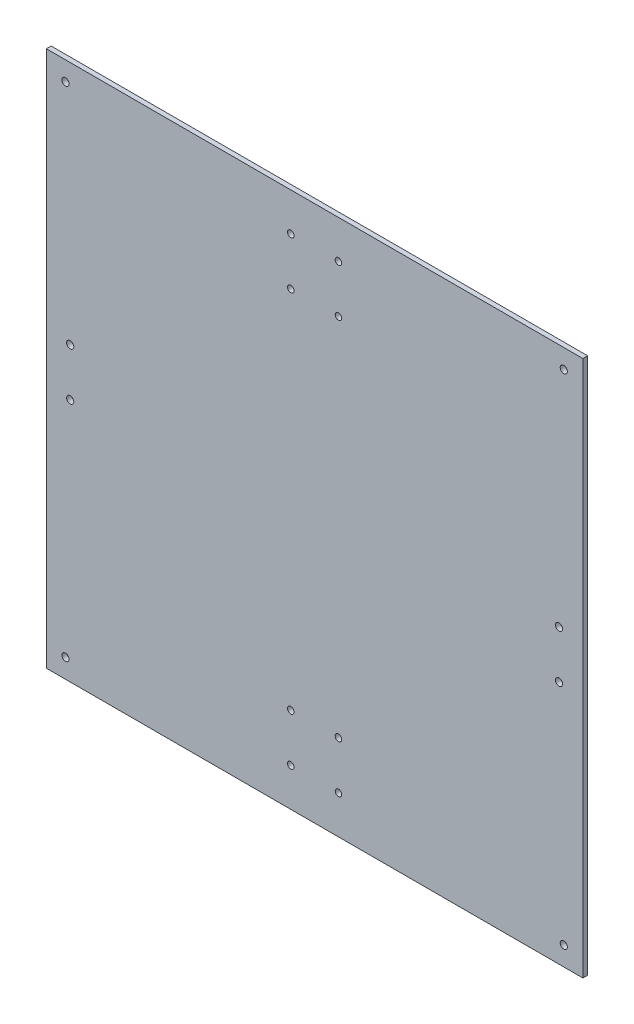
ISO-10303-21;
HEADER;
FILE_DESCRIPTION(('STEP AP214'),'2;1');
FILE_NAME('part.step','',(''),(''),'','','');
FILE_SCHEMA(('AUTOMOTIVE_DESIGN { 1 0 10303 214 1 1 1 1 }'));
ENDSEC;
DATA;
#1=APPLICATION_CONTEXT('core data for automotive mechanical design processes');
#2=APPLICATION_PROTOCOL_DEFINITION('international standard','automotive_design',2000,#1);
#3=PRODUCT_CONTEXT('',#1,'mechanical');
#4=PRODUCT('Part','Part','',(#3));
#5=PRODUCT_RELATED_PRODUCT_CATEGORY('part','',(#4));
#6=PRODUCT_DEFINITION_FORMATION('','',#4);
#7=PRODUCT_DEFINITION_CONTEXT('part definition',#1,'design');
#8=PRODUCT_DEFINITION('design','',#6,#7);
#9=PRODUCT_DEFINITION_SHAPE('','',#8);
#10=(LENGTH_UNIT() NAMED_UNIT(*) SI_UNIT(.MILLI.,.METRE.));
#11=(NAMED_UNIT(*) PLANE_ANGLE_UNIT() SI_UNIT($,.RADIAN.));
#12=(NAMED_UNIT(*) SI_UNIT($,.STERADIAN.) SOLID_ANGLE_UNIT());
#13=UNCERTAINTY_MEASURE_WITH_UNIT(LENGTH_MEASURE(1.E-05),#10,'distance_accuracy_value','');
#14=(GEOMETRIC_REPRESENTATION_CONTEXT(3) GLOBAL_UNCERTAINTY_ASSIGNED_CONTEXT((#13)) GLOBAL_UNIT_ASSIGNED_CONTEXT((#10,
#11,#12)) REPRESENTATION_CONTEXT('',''));
#15=CARTESIAN_POINT('',(0.,0.,0.));
#16=DIRECTION('',(0.,0.,1.));
#17=DIRECTION('',(1.,0.,0.));
#18=AXIS2_PLACEMENT_3D('',#15,#16,#17);
#19=CARTESIAN_POINT('',(0.,-199.,2.));
#20=DIRECTION('',(0.,-1.,0.));
#21=DIRECTION('',(1.,0.,0.));
#22=AXIS2_PLACEMENT_3D('',#19,#20,#21);
#23=PLANE('',#22);
#24=DIRECTION('',(-1.,0.,0.));
#25=VECTOR('',#24,1.);
#26=CARTESIAN_POINT('',(0.,-199.,0.));
#27=LINE('',#26,#25);
#28=CARTESIAN_POINT('',(112.5,-199.,0.));
#29=VERTEX_POINT('',#28);
#30=CARTESIAN_POINT('',(-112.5,-199.,0.));
#31=VERTEX_POINT('',#30);
#32=EDGE_CURVE('E149',#29,#31,#27,.T.);
#33=ORIENTED_EDGE('',*,*,#32,.F.);
#34=DIRECTION('',(0.,0.,-1.));
#35=VECTOR('',#34,1.);
#36=CARTESIAN_POINT('',(112.5,-199.,2.));
#37=LINE('',#36,#35);
#38=CARTESIAN_POINT('',(112.5,-199.,2.));
#39=VERTEX_POINT('',#38);
#40=EDGE_CURVE('E11',#39,#29,#37,.T.);
#41=ORIENTED_EDGE('',*,*,#40,.F.);
#42=DIRECTION('',(-1.,0.,0.));
#43=VECTOR('',#42,1.);
#44=CARTESIAN_POINT('',(0.,-199.,2.));
#45=LINE('',#44,#43);
#46=CARTESIAN_POINT('',(-112.5,-199.,2.));
#47=VERTEX_POINT('',#46);
#48=EDGE_CURVE('E94',#39,#47,#45,.T.);
#49=ORIENTED_EDGE('',*,*,#48,.T.);
#50=DIRECTION('',(0.,0.,-1.));
#51=VECTOR('',#50,1.);
#52=CARTESIAN_POINT('',(-112.5,-199.,2.));
#53=LINE('',#52,#51);
#54=EDGE_CURVE('E72',#47,#31,#53,.T.);
#55=ORIENTED_EDGE('',*,*,#54,.T.);
#56=EDGE_LOOP('',(#33,#41,#49,#55));
#57=FACE_BOUND('',#56,.T.);
#58=ADVANCED_FACE('F32',(#57),#23,.T.);
#59=CARTESIAN_POINT('',(112.5,0.,2.));
#60=DIRECTION('',(1.,0.,0.));
#61=DIRECTION('',(0.,1.,0.));
#62=AXIS2_PLACEMENT_3D('',#59,#60,#61);
#63=PLANE('',#62);
#64=DIRECTION('',(0.,-1.,0.));
#65=VECTOR('',#64,1.);
#66=CARTESIAN_POINT('',(112.5,0.,0.));
#67=LINE('',#66,#65);
#68=CARTESIAN_POINT('',(112.5,26.0000000000001,0.));
#69=VERTEX_POINT('',#68);
#70=EDGE_CURVE('E84',#69,#29,#67,.T.);
#71=ORIENTED_EDGE('',*,*,#70,.F.);
#72=DIRECTION('',(0.,0.,-1.));
#73=VECTOR('',#72,1.);
#74=CARTESIAN_POINT('',(112.5,26.0000000000001,2.));
#75=LINE('',#74,#73);
#76=CARTESIAN_POINT('',(112.5,26.0000000000001,2.));
#77=VERTEX_POINT('',#76);
#78=EDGE_CURVE('E41',#77,#69,#75,.T.);
#79=ORIENTED_EDGE('',*,*,#78,.F.);
#80=DIRECTION('',(0.,-1.,0.));
#81=VECTOR('',#80,1.);
#82=CARTESIAN_POINT('',(112.5,0.,2.));
#83=LINE('',#82,#81);
#84=EDGE_CURVE('E82',#77,#39,#83,.T.);
#85=ORIENTED_EDGE('',*,*,#84,.T.);
#86=ORIENTED_EDGE('',*,*,#40,.T.);
#87=EDGE_LOOP('',(#71,#79,#85,#86));
#88=FACE_BOUND('',#87,.T.);
#89=ADVANCED_FACE('F80',(#88),#63,.T.);
#90=CARTESIAN_POINT('',(0.,26.0000000000001,2.));
#91=DIRECTION('',(0.,-1.,0.));
#92=DIRECTION('',(1.,0.,0.));
#93=AXIS2_PLACEMENT_3D('',#90,#91,#92);
#94=PLANE('',#93);
#95=DIRECTION('',(-1.,0.,0.));
#96=VECTOR('',#95,1.);
#97=CARTESIAN_POINT('',(0.,26.0000000000001,0.));
#98=LINE('',#97,#96);
#99=CARTESIAN_POINT('',(-112.5,26.0000000000001,0.));
#100=VERTEX_POINT('',#99);
#101=EDGE_CURVE('E152',#69,#100,#98,.T.);
#102=ORIENTED_EDGE('',*,*,#101,.T.);
#103=DIRECTION('',(0.,0.,-1.));
#104=VECTOR('',#103,1.);
#105=CARTESIAN_POINT('',(-112.5,26.0000000000001,2.));
#106=LINE('',#105,#104);
#107=CARTESIAN_POINT('',(-112.5,26.0000000000001,2.));
#108=VERTEX_POINT('',#107);
#109=EDGE_CURVE('E87',#108,#100,#106,.T.);
#110=ORIENTED_EDGE('',*,*,#109,.F.);
#111=DIRECTION('',(-1.,0.,0.));
#112=VECTOR('',#111,1.);
#113=CARTESIAN_POINT('',(0.,26.0000000000001,2.));
#114=LINE('',#113,#112);
#115=EDGE_CURVE('E89',#77,#108,#114,.T.);
#116=ORIENTED_EDGE('',*,*,#115,.F.);
#117=ORIENTED_EDGE('',*,*,#78,.T.);
#118=EDGE_LOOP('',(#102,#110,#116,#117));
#119=FACE_BOUND('',#118,.T.);
#120=ADVANCED_FACE('F90',(#119),#94,.F.);
#121=CARTESIAN_POINT('',(102.5,-76.4999999999999,2.));
#122=DIRECTION('',(0.,0.,-1.));
#123=DIRECTION('',(-1.,0.,0.));
#124=AXIS2_PLACEMENT_3D('',#121,#122,#123);
#125=CYLINDRICAL_SURFACE('',#124,1.5);
#126=CARTESIAN_POINT('',(102.5,-76.4999999999999,2.));
#127=DIRECTION('',(0.,0.,1.));
#128=DIRECTION('',(1.,0.,0.));
#129=AXIS2_PLACEMENT_3D('',#126,#127,#128);
#130=CIRCLE('',#129,1.5);
#131=CARTESIAN_POINT('',(104.,-76.4999999999999,2.));
#132=VERTEX_POINT('',#131);
#133=EDGE_CURVE('E131',#132,#132,#130,.T.);
#134=ORIENTED_EDGE('',*,*,#133,.T.);
#135=EDGE_LOOP('',(#134));
#136=FACE_BOUND('',#135,.T.);
#137=CARTESIAN_POINT('',(102.5,-76.4999999999999,0.));
#138=DIRECTION('',(0.,0.,1.));
#139=DIRECTION('',(1.,0.,0.));
#140=AXIS2_PLACEMENT_3D('',#137,#138,#139);
#141=CIRCLE('',#140,1.5);
#142=CARTESIAN_POINT('',(104.,-76.4999999999999,0.));
#143=VERTEX_POINT('',#142);
#144=EDGE_CURVE('E185',#143,#143,#141,.T.);
#145=ORIENTED_EDGE('',*,*,#144,.F.);
#146=EDGE_LOOP('',(#145));
#147=FACE_BOUND('',#146,.T.);
#148=ADVANCED_FACE('F244',(#136,#147),#125,.F.);
#149=CARTESIAN_POINT('',(9.9999999999999,-163.,2.));
#150=DIRECTION('',(0.,0.,-1.));
#151=DIRECTION('',(-1.,0.,0.));
#152=AXIS2_PLACEMENT_3D('',#149,#150,#151);
#153=CYLINDRICAL_SURFACE('',#152,1.37499999999999);
#154=CARTESIAN_POINT('',(9.9999999999999,-163.,2.));
#155=DIRECTION('',(0.,0.,1.));
#156=DIRECTION('',(1.,0.,0.));
#157=AXIS2_PLACEMENT_3D('',#154,#155,#156);
#158=CIRCLE('',#157,1.37499999999999);
#159=CARTESIAN_POINT('',(11.3749999999999,-163.,2.));
#160=VERTEX_POINT('',#159);
#161=EDGE_CURVE('E128',#160,#160,#158,.T.);
#162=ORIENTED_EDGE('',*,*,#161,.T.);
#163=EDGE_LOOP('',(#162));
#164=FACE_BOUND('',#163,.T.);
#165=CARTESIAN_POINT('',(9.9999999999999,-163.,0.));
#166=DIRECTION('',(0.,0.,1.));
#167=DIRECTION('',(1.,0.,0.));
#168=AXIS2_PLACEMENT_3D('',#165,#166,#167);
#169=CIRCLE('',#168,1.37499999999999);
#170=CARTESIAN_POINT('',(11.3749999999999,-163.,0.));
#171=VERTEX_POINT('',#170);
#172=EDGE_CURVE('E182',#171,#171,#169,.T.);
#173=ORIENTED_EDGE('',*,*,#172,.F.);
#174=EDGE_LOOP('',(#173));
#175=FACE_BOUND('',#174,.T.);
#176=ADVANCED_FACE('F247',(#164,#175),#153,.F.);
#177=CARTESIAN_POINT('',(9.9999999999999,-183.,2.));
#178=DIRECTION('',(0.,0.,-1.));
#179=DIRECTION('',(-1.,0.,0.));
#180=AXIS2_PLACEMENT_3D('',#177,#178,#179);
#181=CYLINDRICAL_SURFACE('',#180,1.35);
#182=CARTESIAN_POINT('',(9.9999999999999,-183.,2.));
#183=DIRECTION('',(0.,0.,1.));
#184=DIRECTION('',(1.,0.,0.));
#185=AXIS2_PLACEMENT_3D('',#182,#183,#184);
#186=CIRCLE('',#185,1.35);
#187=CARTESIAN_POINT('',(11.3499999999999,-183.,2.));
#188=VERTEX_POINT('',#187);
#189=EDGE_CURVE('E125',#188,#188,#186,.T.);
#190=ORIENTED_EDGE('',*,*,#189,.T.);
#191=EDGE_LOOP('',(#190));
#192=FACE_BOUND('',#191,.T.);
#193=CARTESIAN_POINT('',(9.9999999999999,-183.,0.));
#194=DIRECTION('',(0.,0.,1.));
#195=DIRECTION('',(1.,0.,0.));
#196=AXIS2_PLACEMENT_3D('',#193,#194,#195);
#197=CIRCLE('',#196,1.35);
#198=CARTESIAN_POINT('',(11.3499999999999,-183.,0.));
#199=VERTEX_POINT('',#198);
#200=EDGE_CURVE('E179',#199,#199,#197,.T.);
#201=ORIENTED_EDGE('',*,*,#200,.F.);
#202=EDGE_LOOP('',(#201));
#203=FACE_BOUND('',#202,.T.);
#204=ADVANCED_FACE('F251',(#192,#203),#181,.F.);
#205=CARTESIAN_POINT('',(10.,10.,2.));
#206=DIRECTION('',(0.,0.,-1.));
#207=DIRECTION('',(-1.,0.,0.));
#208=AXIS2_PLACEMENT_3D('',#205,#206,#207);
#209=CYLINDRICAL_SURFACE('',#208,1.375);
#210=CARTESIAN_POINT('',(10.,10.,2.));
#211=DIRECTION('',(0.,0.,1.));
#212=DIRECTION('',(1.,0.,0.));
#213=AXIS2_PLACEMENT_3D('',#210,#211,#212);
#214=CIRCLE('',#213,1.375);
#215=CARTESIAN_POINT('',(11.375,10.,2.));
#216=VERTEX_POINT('',#215);
#217=EDGE_CURVE('E122',#216,#216,#214,.T.);
#218=ORIENTED_EDGE('',*,*,#217,.T.);
#219=EDGE_LOOP('',(#218));
#220=FACE_BOUND('',#219,.T.);
#221=CARTESIAN_POINT('',(10.,10.,0.));
#222=DIRECTION('',(0.,0.,1.));
#223=DIRECTION('',(1.,0.,0.));
#224=AXIS2_PLACEMENT_3D('',#221,#222,#223);
#225=CIRCLE('',#224,1.375);
#226=CARTESIAN_POINT('',(11.375,10.,0.));
#227=VERTEX_POINT('',#226);
#228=EDGE_CURVE('E176',#227,#227,#225,.T.);
#229=ORIENTED_EDGE('',*,*,#228,.F.);
#230=EDGE_LOOP('',(#229));
#231=FACE_BOUND('',#230,.T.);
#232=ADVANCED_FACE('F255',(#220,#231),#209,.F.);
#233=CARTESIAN_POINT('',(10.,-10.,2.));
#234=DIRECTION('',(0.,0.,-1.));
#235=DIRECTION('',(-1.,0.,0.));
#236=AXIS2_PLACEMENT_3D('',#233,#234,#235);
#237=CYLINDRICAL_SURFACE('',#236,1.35);
#238=CARTESIAN_POINT('',(10.,-10.,2.));
#239=DIRECTION('',(0.,0.,1.));
#240=DIRECTION('',(1.,0.,0.));
#241=AXIS2_PLACEMENT_3D('',#238,#239,#240);
#242=CIRCLE('',#241,1.35);
#243=CARTESIAN_POINT('',(11.35,-10.,2.));
#244=VERTEX_POINT('',#243);
#245=EDGE_CURVE('E119',#244,#244,#242,.T.);
#246=ORIENTED_EDGE('',*,*,#245,.T.);
#247=EDGE_LOOP('',(#246));
#248=FACE_BOUND('',#247,.T.);
#249=CARTESIAN_POINT('',(10.,-10.,0.));
#250=DIRECTION('',(0.,0.,1.));
#251=DIRECTION('',(1.,0.,0.));
#252=AXIS2_PLACEMENT_3D('',#249,#250,#251);
#253=CIRCLE('',#252,1.35);
#254=CARTESIAN_POINT('',(11.35,-10.,0.));
#255=VERTEX_POINT('',#254);
#256=EDGE_CURVE('E173',#255,#255,#253,.T.);
#257=ORIENTED_EDGE('',*,*,#256,.F.);
#258=EDGE_LOOP('',(#257));
#259=FACE_BOUND('',#258,.T.);
#260=ADVANCED_FACE('F259',(#248,#259),#237,.F.);
#261=CARTESIAN_POINT('',(-102.5,-96.4999999999999,2.));
#262=DIRECTION('',(0.,0.,-1.));
#263=DIRECTION('',(-1.,0.,0.));
#264=AXIS2_PLACEMENT_3D('',#261,#262,#263);
#265=CYLINDRICAL_SURFACE('',#264,1.5);
#266=CARTESIAN_POINT('',(-102.5,-96.4999999999999,2.));
#267=DIRECTION('',(0.,0.,1.));
#268=DIRECTION('',(1.,0.,0.));
#269=AXIS2_PLACEMENT_3D('',#266,#267,#268);
#270=CIRCLE('',#269,1.5);
#271=CARTESIAN_POINT('',(-101.,-96.4999999999999,2.));
#272=VERTEX_POINT('',#271);
#273=EDGE_CURVE('E116',#272,#272,#270,.F.);
#274=ORIENTED_EDGE('',*,*,#273,.F.);
#275=EDGE_LOOP('',(#274));
#276=FACE_BOUND('',#275,.T.);
#277=CARTESIAN_POINT('',(-102.5,-96.4999999999999,0.));
#278=DIRECTION('',(0.,0.,1.));
#279=DIRECTION('',(1.,0.,0.));
#280=AXIS2_PLACEMENT_3D('',#277,#278,#279);
#281=CIRCLE('',#280,1.5);
#282=CARTESIAN_POINT('',(-101.,-96.4999999999999,0.));
#283=VERTEX_POINT('',#282);
#284=EDGE_CURVE('E170',#283,#283,#281,.F.);
#285=ORIENTED_EDGE('',*,*,#284,.T.);
#286=EDGE_LOOP('',(#285));
#287=FACE_BOUND('',#286,.T.);
#288=ADVANCED_FACE('F263',(#276,#287),#265,.F.);
#289=CARTESIAN_POINT('',(-10.,-10.,2.));
#290=DIRECTION('',(0.,0.,-1.));
#291=DIRECTION('',(-1.,0.,0.));
#292=AXIS2_PLACEMENT_3D('',#289,#290,#291);
#293=CYLINDRICAL_SURFACE('',#292,1.375);
#294=CARTESIAN_POINT('',(-10.,-10.,2.));
#295=DIRECTION('',(0.,0.,1.));
#296=DIRECTION('',(1.,0.,0.));
#297=AXIS2_PLACEMENT_3D('',#294,#295,#296);
#298=CIRCLE('',#297,1.375);
#299=CARTESIAN_POINT('',(-8.62500000000001,-10.,2.));
#300=VERTEX_POINT('',#299);
#301=EDGE_CURVE('E113',#300,#300,#298,.T.);
#302=ORIENTED_EDGE('',*,*,#301,.T.);
#303=EDGE_LOOP('',(#302));
#304=FACE_BOUND('',#303,.T.);
#305=CARTESIAN_POINT('',(-10.,-10.,0.));
#306=DIRECTION('',(0.,0.,1.));
#307=DIRECTION('',(1.,0.,0.));
#308=AXIS2_PLACEMENT_3D('',#305,#306,#307);
#309=CIRCLE('',#308,1.375);
#310=CARTESIAN_POINT('',(-8.62500000000001,-10.,0.));
#311=VERTEX_POINT('',#310);
#312=EDGE_CURVE('E167',#311,#311,#309,.T.);
#313=ORIENTED_EDGE('',*,*,#312,.F.);
#314=EDGE_LOOP('',(#313));
#315=FACE_BOUND('',#314,.T.);
#316=ADVANCED_FACE('F267',(#304,#315),#293,.F.);
#317=CARTESIAN_POINT('',(-10.,10.,2.));
#318=DIRECTION('',(0.,0.,-1.));
#319=DIRECTION('',(-1.,0.,0.));
#320=AXIS2_PLACEMENT_3D('',#317,#318,#319);
#321=CYLINDRICAL_SURFACE('',#320,1.375);
#322=CARTESIAN_POINT('',(-10.,10.,2.));
#323=DIRECTION('',(0.,0.,1.));
#324=DIRECTION('',(1.,0.,0.));
#325=AXIS2_PLACEMENT_3D('',#322,#323,#324);
#326=CIRCLE('',#325,1.375);
#327=CARTESIAN_POINT('',(-8.62500000000001,10.,2.));
#328=VERTEX_POINT('',#327);
#329=EDGE_CURVE('E110',#328,#328,#326,.T.);
#330=ORIENTED_EDGE('',*,*,#329,.T.);
#331=EDGE_LOOP('',(#330));
#332=FACE_BOUND('',#331,.T.);
#333=CARTESIAN_POINT('',(-10.,10.,0.));
#334=DIRECTION('',(0.,0.,1.));
#335=DIRECTION('',(1.,0.,0.));
#336=AXIS2_PLACEMENT_3D('',#333,#334,#335);
#337=CIRCLE('',#336,1.375);
#338=CARTESIAN_POINT('',(-8.62500000000001,10.,0.));
#339=VERTEX_POINT('',#338);
#340=EDGE_CURVE('E164',#339,#339,#337,.T.);
#341=ORIENTED_EDGE('',*,*,#340,.F.);
#342=EDGE_LOOP('',(#341));
#343=FACE_BOUND('',#342,.T.);
#344=ADVANCED_FACE('F271',(#332,#343),#321,.F.);
#345=CARTESIAN_POINT('',(-10.0000000000001,-183.,2.));
#346=DIRECTION('',(0.,0.,-1.));
#347=DIRECTION('',(-1.,0.,0.));
#348=AXIS2_PLACEMENT_3D('',#345,#346,#347);
#349=CYLINDRICAL_SURFACE('',#348,1.37500000000001);
#350=CARTESIAN_POINT('',(-10.0000000000001,-183.,2.));
#351=DIRECTION('',(0.,0.,1.));
#352=DIRECTION('',(1.,0.,0.));
#353=AXIS2_PLACEMENT_3D('',#350,#351,#352);
#354=CIRCLE('',#353,1.37500000000001);
#355=CARTESIAN_POINT('',(-8.62500000000011,-183.,2.));
#356=VERTEX_POINT('',#355);
#357=EDGE_CURVE('E107',#356,#356,#354,.T.);
#358=ORIENTED_EDGE('',*,*,#357,.T.);
#359=EDGE_LOOP('',(#358));
#360=FACE_BOUND('',#359,.T.);
#361=CARTESIAN_POINT('',(-10.0000000000001,-183.,0.));
#362=DIRECTION('',(0.,0.,1.));
#363=DIRECTION('',(1.,0.,0.));
#364=AXIS2_PLACEMENT_3D('',#361,#362,#363);
#365=CIRCLE('',#364,1.37500000000001);
#366=CARTESIAN_POINT('',(-8.62500000000011,-183.,0.));
#367=VERTEX_POINT('',#366);
#368=EDGE_CURVE('E161',#367,#367,#365,.T.);
#369=ORIENTED_EDGE('',*,*,#368,.F.);
#370=EDGE_LOOP('',(#369));
#371=FACE_BOUND('',#370,.T.);
#372=ADVANCED_FACE('F275',(#360,#371),#349,.F.);
#373=CARTESIAN_POINT('',(-10.0000000000001,-163.,2.));
#374=DIRECTION('',(0.,0.,-1.));
#375=DIRECTION('',(-1.,0.,0.));
#376=AXIS2_PLACEMENT_3D('',#373,#374,#375);
#377=CYLINDRICAL_SURFACE('',#376,1.375);
#378=CARTESIAN_POINT('',(-10.0000000000001,-163.,2.));
#379=DIRECTION('',(0.,0.,1.));
#380=DIRECTION('',(1.,0.,0.));
#381=AXIS2_PLACEMENT_3D('',#378,#379,#380);
#382=CIRCLE('',#381,1.375);
#383=CARTESIAN_POINT('',(-8.62500000000012,-163.,2.));
#384=VERTEX_POINT('',#383);
#385=EDGE_CURVE('E104',#384,#384,#382,.T.);
#386=ORIENTED_EDGE('',*,*,#385,.T.);
#387=EDGE_LOOP('',(#386));
#388=FACE_BOUND('',#387,.T.);
#389=CARTESIAN_POINT('',(-10.0000000000001,-163.,0.));
#390=DIRECTION('',(0.,0.,1.));
#391=DIRECTION('',(1.,0.,0.));
#392=AXIS2_PLACEMENT_3D('',#389,#390,#391);
#393=CIRCLE('',#392,1.375);
#394=CARTESIAN_POINT('',(-8.62500000000012,-163.,0.));
#395=VERTEX_POINT('',#394);
#396=EDGE_CURVE('E158',#395,#395,#393,.T.);
#397=ORIENTED_EDGE('',*,*,#396,.F.);
#398=EDGE_LOOP('',(#397));
#399=FACE_BOUND('',#398,.T.);
#400=ADVANCED_FACE('F279',(#388,#399),#377,.F.);
#401=CARTESIAN_POINT('',(-102.5,-76.4999999999999,2.));
#402=DIRECTION('',(0.,0.,-1.));
#403=DIRECTION('',(-1.,0.,0.));
#404=AXIS2_PLACEMENT_3D('',#401,#402,#403);
#405=CYLINDRICAL_SURFACE('',#404,1.5);
#406=CARTESIAN_POINT('',(-102.5,-76.4999999999999,2.));
#407=DIRECTION('',(0.,0.,1.));
#408=DIRECTION('',(1.,0.,0.));
#409=AXIS2_PLACEMENT_3D('',#406,#407,#408);
#410=CIRCLE('',#409,1.5);
#411=CARTESIAN_POINT('',(-101.,-76.4999999999999,2.));
#412=VERTEX_POINT('',#411);
#413=EDGE_CURVE('E101',#412,#412,#410,.F.);
#414=ORIENTED_EDGE('',*,*,#413,.F.);
#415=EDGE_LOOP('',(#414));
#416=FACE_BOUND('',#415,.T.);
#417=CARTESIAN_POINT('',(-102.5,-76.4999999999999,0.));
#418=DIRECTION('',(0.,0.,1.));
#419=DIRECTION('',(1.,0.,0.));
#420=AXIS2_PLACEMENT_3D('',#417,#418,#419);
#421=CIRCLE('',#420,1.5);
#422=CARTESIAN_POINT('',(-101.,-76.4999999999999,0.));
#423=VERTEX_POINT('',#422);
#424=EDGE_CURVE('E155',#423,#423,#421,.F.);
#425=ORIENTED_EDGE('',*,*,#424,.T.);
#426=EDGE_LOOP('',(#425));
#427=FACE_BOUND('',#426,.T.);
#428=ADVANCED_FACE('F283',(#416,#427),#405,.F.);
#429=CARTESIAN_POINT('',(-112.5,0.,2.));
#430=DIRECTION('',(1.,0.,0.));
#431=DIRECTION('',(0.,1.,0.));
#432=AXIS2_PLACEMENT_3D('',#429,#430,#431);
#433=PLANE('',#432);
#434=DIRECTION('',(0.,-1.,0.));
#435=VECTOR('',#434,1.);
#436=CARTESIAN_POINT('',(-112.5,0.,0.));
#437=LINE('',#436,#435);
#438=EDGE_CURVE('E65',#100,#31,#437,.T.);
#439=ORIENTED_EDGE('',*,*,#438,.T.);
#440=ORIENTED_EDGE('',*,*,#54,.F.);
#441=DIRECTION('',(0.,-1.,0.));
#442=VECTOR('',#441,1.);
#443=CARTESIAN_POINT('',(-112.5,0.,2.));
#444=LINE('',#443,#442);
#445=EDGE_CURVE('E49',#108,#47,#444,.T.);
#446=ORIENTED_EDGE('',*,*,#445,.F.);
#447=ORIENTED_EDGE('',*,*,#109,.T.);
#448=EDGE_LOOP('',(#439,#440,#446,#447));
#449=FACE_BOUND('',#448,.T.);
#450=ADVANCED_FACE('F194',(#449),#433,.F.);
#451=CARTESIAN_POINT('',(-104.5,-191.,2.));
#452=DIRECTION('',(0.,0.,-1.));
#453=DIRECTION('',(-1.,0.,0.));
#454=AXIS2_PLACEMENT_3D('',#451,#452,#453);
#455=CYLINDRICAL_SURFACE('',#454,1.5);
#456=CARTESIAN_POINT('',(-104.5,-191.,2.));
#457=DIRECTION('',(0.,0.,1.));
#458=DIRECTION('',(1.,0.,0.));
#459=AXIS2_PLACEMENT_3D('',#456,#457,#458);
#460=CIRCLE('',#459,1.5);
#461=CARTESIAN_POINT('',(-103.,-191.,2.));
#462=VERTEX_POINT('',#461);
#463=EDGE_CURVE('E96',#462,#462,#460,.T.);
#464=ORIENTED_EDGE('',*,*,#463,.T.);
#465=EDGE_LOOP('',(#464));
#466=FACE_BOUND('',#465,.T.);
#467=CARTESIAN_POINT('',(-104.5,-191.,0.));
#468=DIRECTION('',(0.,0.,1.));
#469=DIRECTION('',(1.,0.,0.));
#470=AXIS2_PLACEMENT_3D('',#467,#468,#469);
#471=CIRCLE('',#470,1.5);
#472=CARTESIAN_POINT('',(-103.,-191.,0.));
#473=VERTEX_POINT('',#472);
#474=EDGE_CURVE('E146',#473,#473,#471,.T.);
#475=ORIENTED_EDGE('',*,*,#474,.F.);
#476=EDGE_LOOP('',(#475));
#477=FACE_BOUND('',#476,.T.);
#478=ADVANCED_FACE('F205',(#466,#477),#455,.F.);
#479=CARTESIAN_POINT('',(-104.5,18.0000000000001,2.));
#480=DIRECTION('',(0.,0.,-1.));
#481=DIRECTION('',(-1.,0.,0.));
#482=AXIS2_PLACEMENT_3D('',#479,#480,#481);
#483=CYLINDRICAL_SURFACE('',#482,1.5);
#484=CARTESIAN_POINT('',(-104.5,18.0000000000001,2.));
#485=DIRECTION('',(0.,0.,1.));
#486=DIRECTION('',(1.,0.,0.));
#487=AXIS2_PLACEMENT_3D('',#484,#485,#486);
#488=CIRCLE('',#487,1.5);
#489=CARTESIAN_POINT('',(-103.,18.0000000000001,2.));
#490=VERTEX_POINT('',#489);
#491=EDGE_CURVE('E501',#490,#490,#488,.T.);
#492=ORIENTED_EDGE('',*,*,#491,.T.);
#493=EDGE_LOOP('',(#492));
#494=FACE_BOUND('',#493,.T.);
#495=CARTESIAN_POINT('',(-104.5,18.0000000000001,0.));
#496=DIRECTION('',(0.,0.,1.));
#497=DIRECTION('',(1.,0.,0.));
#498=AXIS2_PLACEMENT_3D('',#495,#496,#497);
#499=CIRCLE('',#498,1.5);
#500=CARTESIAN_POINT('',(-103.,18.0000000000001,0.));
#501=VERTEX_POINT('',#500);
#502=EDGE_CURVE('E143',#501,#501,#499,.T.);
#503=ORIENTED_EDGE('',*,*,#502,.F.);
#504=EDGE_LOOP('',(#503));
#505=FACE_BOUND('',#504,.T.);
#506=ADVANCED_FACE('F208',(#494,#505),#483,.F.);
#507=CARTESIAN_POINT('',(104.5,18.0000000000001,2.));
#508=DIRECTION('',(0.,0.,-1.));
#509=DIRECTION('',(-1.,0.,0.));
#510=AXIS2_PLACEMENT_3D('',#507,#508,#509);
#511=CYLINDRICAL_SURFACE('',#510,1.5);
#512=CARTESIAN_POINT('',(104.5,18.0000000000001,2.));
#513=DIRECTION('',(0.,0.,1.));
#514=DIRECTION('',(1.,0.,0.));
#515=AXIS2_PLACEMENT_3D('',#512,#513,#514);
#516=CIRCLE('',#515,1.5);
#517=CARTESIAN_POINT('',(106.,18.0000000000001,2.));
#518=VERTEX_POINT('',#517);
#519=EDGE_CURVE('E223',#518,#518,#516,.T.);
#520=ORIENTED_EDGE('',*,*,#519,.T.);
#521=EDGE_LOOP('',(#520));
#522=FACE_BOUND('',#521,.T.);
#523=CARTESIAN_POINT('',(104.5,18.0000000000001,0.));
#524=DIRECTION('',(0.,0.,1.));
#525=DIRECTION('',(1.,0.,0.));
#526=AXIS2_PLACEMENT_3D('',#523,#524,#525);
#527=CIRCLE('',#526,1.5);
#528=CARTESIAN_POINT('',(106.,18.0000000000001,0.));
#529=VERTEX_POINT('',#528);
#530=EDGE_CURVE('E140',#529,#529,#527,.T.);
#531=ORIENTED_EDGE('',*,*,#530,.F.);
#532=EDGE_LOOP('',(#531));
#533=FACE_BOUND('',#532,.T.);
#534=ADVANCED_FACE('F211',(#522,#533),#511,.F.);
#535=CARTESIAN_POINT('',(104.5,-191.,2.));
#536=DIRECTION('',(0.,0.,-1.));
#537=DIRECTION('',(-1.,0.,0.));
#538=AXIS2_PLACEMENT_3D('',#535,#536,#537);
#539=CYLINDRICAL_SURFACE('',#538,1.5);
#540=CARTESIAN_POINT('',(104.5,-191.,2.));
#541=DIRECTION('',(0.,0.,1.));
#542=DIRECTION('',(1.,0.,0.));
#543=AXIS2_PLACEMENT_3D('',#540,#541,#542);
#544=CIRCLE('',#543,1.5);
#545=CARTESIAN_POINT('',(106.,-191.,2.));
#546=VERTEX_POINT('',#545);
#547=EDGE_CURVE('E191',#546,#546,#544,.T.);
#548=ORIENTED_EDGE('',*,*,#547,.T.);
#549=EDGE_LOOP('',(#548));
#550=FACE_BOUND('',#549,.T.);
#551=CARTESIAN_POINT('',(104.5,-191.,0.));
#552=DIRECTION('',(0.,0.,1.));
#553=DIRECTION('',(1.,0.,0.));
#554=AXIS2_PLACEMENT_3D('',#551,#552,#553);
#555=CIRCLE('',#554,1.5);
#556=CARTESIAN_POINT('',(106.,-191.,0.));
#557=VERTEX_POINT('',#556);
#558=EDGE_CURVE('E137',#557,#557,#555,.T.);
#559=ORIENTED_EDGE('',*,*,#558,.F.);
#560=EDGE_LOOP('',(#559));
#561=FACE_BOUND('',#560,.T.);
#562=ADVANCED_FACE('F34',(#550,#561),#539,.F.);
#563=CARTESIAN_POINT('',(102.5,-96.4999999999999,2.));
#564=DIRECTION('',(0.,0.,-1.));
#565=DIRECTION('',(-1.,0.,0.));
#566=AXIS2_PLACEMENT_3D('',#563,#564,#565);
#567=CYLINDRICAL_SURFACE('',#566,1.5);
#568=CARTESIAN_POINT('',(102.5,-96.4999999999999,2.));
#569=DIRECTION('',(0.,0.,1.));
#570=DIRECTION('',(1.,0.,0.));
#571=AXIS2_PLACEMENT_3D('',#568,#569,#570);
#572=CIRCLE('',#571,1.5);
#573=CARTESIAN_POINT('',(104.,-96.4999999999999,2.));
#574=VERTEX_POINT('',#573);
#575=EDGE_CURVE('E134',#574,#574,#572,.T.);
#576=ORIENTED_EDGE('',*,*,#575,.T.);
#577=EDGE_LOOP('',(#576));
#578=FACE_BOUND('',#577,.T.);
#579=CARTESIAN_POINT('',(102.5,-96.4999999999999,0.));
#580=DIRECTION('',(0.,0.,1.));
#581=DIRECTION('',(1.,0.,0.));
#582=AXIS2_PLACEMENT_3D('',#579,#580,#581);
#583=CIRCLE('',#582,1.5);
#584=CARTESIAN_POINT('',(104.,-96.4999999999999,0.));
#585=VERTEX_POINT('',#584);
#586=EDGE_CURVE('E188',#585,#585,#583,.T.);
#587=ORIENTED_EDGE('',*,*,#586,.F.);
#588=EDGE_LOOP('',(#587));
#589=FACE_BOUND('',#588,.T.);
#590=ADVANCED_FACE('F218',(#578,#589),#567,.F.);
#591=CARTESIAN_POINT('',(0.,0.,2.));
#592=DIRECTION('',(0.,0.,1.));
#593=DIRECTION('',(1.,0.,0.));
#594=AXIS2_PLACEMENT_3D('',#591,#592,#593);
#595=PLANE('',#594);
#596=ORIENTED_EDGE('',*,*,#547,.F.);
#597=EDGE_LOOP('',(#596));
#598=FACE_BOUND('',#597,.T.);
#599=ORIENTED_EDGE('',*,*,#519,.F.);
#600=EDGE_LOOP('',(#599));
#601=FACE_BOUND('',#600,.T.);
#602=ORIENTED_EDGE('',*,*,#491,.F.);
#603=EDGE_LOOP('',(#602));
#604=FACE_BOUND('',#603,.T.);
#605=ORIENTED_EDGE('',*,*,#463,.F.);
#606=EDGE_LOOP('',(#605));
#607=FACE_BOUND('',#606,.T.);
#608=ORIENTED_EDGE('',*,*,#48,.F.);
#609=ORIENTED_EDGE('',*,*,#84,.F.);
#610=ORIENTED_EDGE('',*,*,#115,.T.);
#611=ORIENTED_EDGE('',*,*,#445,.T.);
#612=EDGE_LOOP('',(#608,#609,#610,#611));
#613=FACE_BOUND('',#612,.T.);
#614=ORIENTED_EDGE('',*,*,#413,.T.);
#615=EDGE_LOOP('',(#614));
#616=FACE_BOUND('',#615,.T.);
#617=ORIENTED_EDGE('',*,*,#385,.F.);
#618=EDGE_LOOP('',(#617));
#619=FACE_BOUND('',#618,.T.);
#620=ORIENTED_EDGE('',*,*,#357,.F.);
#621=EDGE_LOOP('',(#620));
#622=FACE_BOUND('',#621,.T.);
#623=ORIENTED_EDGE('',*,*,#329,.F.);
#624=EDGE_LOOP('',(#623));
#625=FACE_BOUND('',#624,.T.);
#626=ORIENTED_EDGE('',*,*,#301,.F.);
#627=EDGE_LOOP('',(#626));
#628=FACE_BOUND('',#627,.T.);
#629=ORIENTED_EDGE('',*,*,#273,.T.);
#630=EDGE_LOOP('',(#629));
#631=FACE_BOUND('',#630,.T.);
#632=ORIENTED_EDGE('',*,*,#245,.F.);
#633=EDGE_LOOP('',(#632));
#634=FACE_BOUND('',#633,.T.);
#635=ORIENTED_EDGE('',*,*,#217,.F.);
#636=EDGE_LOOP('',(#635));
#637=FACE_BOUND('',#636,.T.);
#638=ORIENTED_EDGE('',*,*,#189,.F.);
#639=EDGE_LOOP('',(#638));
#640=FACE_BOUND('',#639,.T.);
#641=ORIENTED_EDGE('',*,*,#161,.F.);
#642=EDGE_LOOP('',(#641));
#643=FACE_BOUND('',#642,.T.);
#644=ORIENTED_EDGE('',*,*,#133,.F.);
#645=EDGE_LOOP('',(#644));
#646=FACE_BOUND('',#645,.T.);
#647=ORIENTED_EDGE('',*,*,#575,.F.);
#648=EDGE_LOOP('',(#647));
#649=FACE_BOUND('',#648,.T.);
#650=ADVANCED_FACE('F92',(#598,#601,#604,#607,#613,#616,#619,#622,#625,#628,#631,#634,#637,#640,
#643,#646,#649),#595,.T.);
#651=CARTESIAN_POINT('',(0.,0.,0.));
#652=DIRECTION('',(0.,0.,1.));
#653=DIRECTION('',(1.,0.,0.));
#654=AXIS2_PLACEMENT_3D('',#651,#652,#653);
#655=PLANE('',#654);
#656=ORIENTED_EDGE('',*,*,#558,.T.);
#657=EDGE_LOOP('',(#656));
#658=FACE_BOUND('',#657,.T.);
#659=ORIENTED_EDGE('',*,*,#530,.T.);
#660=EDGE_LOOP('',(#659));
#661=FACE_BOUND('',#660,.T.);
#662=ORIENTED_EDGE('',*,*,#502,.T.);
#663=EDGE_LOOP('',(#662));
#664=FACE_BOUND('',#663,.T.);
#665=ORIENTED_EDGE('',*,*,#474,.T.);
#666=EDGE_LOOP('',(#665));
#667=FACE_BOUND('',#666,.T.);
#668=ORIENTED_EDGE('',*,*,#32,.T.);
#669=ORIENTED_EDGE('',*,*,#438,.F.);
#670=ORIENTED_EDGE('',*,*,#101,.F.);
#671=ORIENTED_EDGE('',*,*,#70,.T.);
#672=EDGE_LOOP('',(#668,#669,#670,#671));
#673=FACE_BOUND('',#672,.T.);
#674=ORIENTED_EDGE('',*,*,#424,.F.);
#675=EDGE_LOOP('',(#674));
#676=FACE_BOUND('',#675,.T.);
#677=ORIENTED_EDGE('',*,*,#396,.T.);
#678=EDGE_LOOP('',(#677));
#679=FACE_BOUND('',#678,.T.);
#680=ORIENTED_EDGE('',*,*,#368,.T.);
#681=EDGE_LOOP('',(#680));
#682=FACE_BOUND('',#681,.T.);
#683=ORIENTED_EDGE('',*,*,#340,.T.);
#684=EDGE_LOOP('',(#683));
#685=FACE_BOUND('',#684,.T.);
#686=ORIENTED_EDGE('',*,*,#312,.T.);
#687=EDGE_LOOP('',(#686));
#688=FACE_BOUND('',#687,.T.);
#689=ORIENTED_EDGE('',*,*,#284,.F.);
#690=EDGE_LOOP('',(#689));
#691=FACE_BOUND('',#690,.T.);
#692=ORIENTED_EDGE('',*,*,#256,.T.);
#693=EDGE_LOOP('',(#692));
#694=FACE_BOUND('',#693,.T.);
#695=ORIENTED_EDGE('',*,*,#228,.T.);
#696=EDGE_LOOP('',(#695));
#697=FACE_BOUND('',#696,.T.);
#698=ORIENTED_EDGE('',*,*,#200,.T.);
#699=EDGE_LOOP('',(#698));
#700=FACE_BOUND('',#699,.T.);
#701=ORIENTED_EDGE('',*,*,#172,.T.);
#702=EDGE_LOOP('',(#701));
#703=FACE_BOUND('',#702,.T.);
#704=ORIENTED_EDGE('',*,*,#144,.T.);
#705=EDGE_LOOP('',(#704));
#706=FACE_BOUND('',#705,.T.);
#707=ORIENTED_EDGE('',*,*,#586,.T.);
#708=EDGE_LOOP('',(#707));
#709=FACE_BOUND('',#708,.T.);
#710=ADVANCED_FACE('F195',(#658,#661,#664,#667,#673,#676,#679,#682,#685,#688,#691,#694,#697,
#700,#703,#706,#709),#655,.F.);
#711=CLOSED_SHELL('',(#58,#89,#120,#148,#176,#204,#232,#260,#288,#316,#344,#372,#400,#428,#450,
#478,#506,#534,#562,#590,#650,#710));
#712=MANIFOLD_SOLID_BREP('B2',#711);
#713=ADVANCED_BREP_SHAPE_REPRESENTATION('',(#18,#712),#14);
#714=SHAPE_DEFINITION_REPRESENTATION(#9,#713);
ENDSEC;
END-ISO-10303-21;
